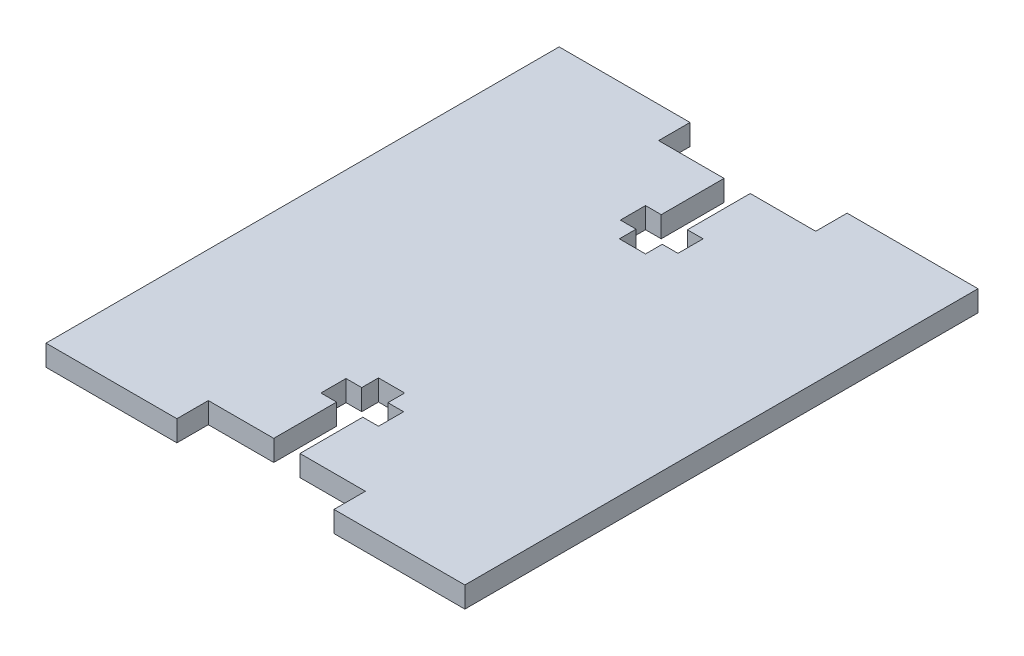
ISO-10303-21;
HEADER;
FILE_DESCRIPTION(('STEP AP214'),'2;1');
FILE_NAME('part.step','',(''),(''),'','','');
FILE_SCHEMA(('AUTOMOTIVE_DESIGN { 1 0 10303 214 1 1 1 1 }'));
ENDSEC;
DATA;
#1=APPLICATION_CONTEXT('core data for automotive mechanical design processes');
#2=APPLICATION_PROTOCOL_DEFINITION('international standard','automotive_design',2000,#1);
#3=PRODUCT_CONTEXT('',#1,'mechanical');
#4=PRODUCT('Part','Part','',(#3));
#5=PRODUCT_RELATED_PRODUCT_CATEGORY('part','',(#4));
#6=PRODUCT_DEFINITION_FORMATION('','',#4);
#7=PRODUCT_DEFINITION_CONTEXT('part definition',#1,'design');
#8=PRODUCT_DEFINITION('design','',#6,#7);
#9=PRODUCT_DEFINITION_SHAPE('','',#8);
#10=(LENGTH_UNIT() NAMED_UNIT(*) SI_UNIT(.MILLI.,.METRE.));
#11=(NAMED_UNIT(*) PLANE_ANGLE_UNIT() SI_UNIT($,.RADIAN.));
#12=(NAMED_UNIT(*) SI_UNIT($,.STERADIAN.) SOLID_ANGLE_UNIT());
#13=UNCERTAINTY_MEASURE_WITH_UNIT(LENGTH_MEASURE(1.E-05),#10,'distance_accuracy_value','');
#14=(GEOMETRIC_REPRESENTATION_CONTEXT(3) GLOBAL_UNCERTAINTY_ASSIGNED_CONTEXT((#13)) GLOBAL_UNIT_ASSIGNED_CONTEXT((#10,
#11,#12)) REPRESENTATION_CONTEXT('',''));
#15=CARTESIAN_POINT('',(0.,0.,0.));
#16=DIRECTION('',(0.,0.,1.));
#17=DIRECTION('',(1.,0.,0.));
#18=AXIS2_PLACEMENT_3D('',#15,#16,#17);
#19=CARTESIAN_POINT('',(-42.0649491402793,-2.,-17.7189241382306));
#20=DIRECTION('',(0.,0.,1.));
#21=DIRECTION('',(1.,0.,0.));
#22=AXIS2_PLACEMENT_3D('',#19,#20,#21);
#23=PLANE('',#22);
#24=DIRECTION('',(1.,0.,0.));
#25=VECTOR('',#24,1.);
#26=CARTESIAN_POINT('',(-42.0649491402793,0.,-17.7189241382306));
#27=LINE('',#26,#25);
#28=CARTESIAN_POINT('',(-42.0649491402793,0.,-17.7189241382306));
#29=VERTEX_POINT('',#28);
#30=CARTESIAN_POINT('',(-35.8149491402793,0.,-17.7189241382306));
#31=VERTEX_POINT('',#30);
#32=EDGE_CURVE('E472',#29,#31,#27,.T.);
#33=ORIENTED_EDGE('',*,*,#32,.T.);
#34=DIRECTION('',(0.,1.,0.));
#35=VECTOR('',#34,1.);
#36=CARTESIAN_POINT('',(-35.8149491402793,-2.,-17.7189241382306));
#37=LINE('',#36,#35);
#38=CARTESIAN_POINT('',(-35.8149491402793,-2.,-17.7189241382306));
#39=VERTEX_POINT('',#38);
#40=EDGE_CURVE('E356',#39,#31,#37,.T.);
#41=ORIENTED_EDGE('',*,*,#40,.F.);
#42=DIRECTION('',(1.,0.,0.));
#43=VECTOR('',#42,1.);
#44=CARTESIAN_POINT('',(-42.0649491402793,-2.,-17.7189241382306));
#45=LINE('',#44,#43);
#46=CARTESIAN_POINT('',(-42.0649491402793,-2.,-17.7189241382306));
#47=VERTEX_POINT('',#46);
#48=EDGE_CURVE('E462',#47,#39,#45,.T.);
#49=ORIENTED_EDGE('',*,*,#48,.F.);
#50=DIRECTION('',(0.,1.,0.));
#51=VECTOR('',#50,1.);
#52=CARTESIAN_POINT('',(-42.0649491402793,-2.,-17.7189241382306));
#53=LINE('',#52,#51);
#54=EDGE_CURVE('E483',#47,#29,#53,.T.);
#55=ORIENTED_EDGE('',*,*,#54,.T.);
#56=EDGE_LOOP('',(#33,#41,#49,#55));
#57=FACE_BOUND('',#56,.T.);
#58=ADVANCED_FACE('F35',(#57),#23,.F.);
#59=CARTESIAN_POINT('',(-42.0649491402793,-2.,25.2810758617694));
#60=DIRECTION('',(0.,0.,-1.));
#61=DIRECTION('',(-1.,0.,0.));
#62=AXIS2_PLACEMENT_3D('',#59,#60,#61);
#63=PLANE('',#62);
#64=DIRECTION('',(-1.,0.,0.));
#65=VECTOR('',#64,1.);
#66=CARTESIAN_POINT('',(-42.0649491402793,0.,25.2810758617694));
#67=LINE('',#66,#65);
#68=CARTESIAN_POINT('',(-27.0649491402793,0.,25.2810758617694));
#69=VERTEX_POINT('',#68);
#70=CARTESIAN_POINT('',(-33.3149491402793,0.,25.2810758617694));
#71=VERTEX_POINT('',#70);
#72=EDGE_CURVE('E490',#69,#71,#67,.T.);
#73=ORIENTED_EDGE('',*,*,#72,.T.);
#74=DIRECTION('',(0.,1.,0.));
#75=VECTOR('',#74,1.);
#76=CARTESIAN_POINT('',(-33.3149491402793,-2.,25.2810758617694));
#77=LINE('',#76,#75);
#78=CARTESIAN_POINT('',(-33.3149491402793,-2.,25.2810758617694));
#79=VERTEX_POINT('',#78);
#80=EDGE_CURVE('E450',#79,#71,#77,.T.);
#81=ORIENTED_EDGE('',*,*,#80,.F.);
#82=DIRECTION('',(-1.,0.,0.));
#83=VECTOR('',#82,1.);
#84=CARTESIAN_POINT('',(-42.0649491402793,-2.,25.2810758617694));
#85=LINE('',#84,#83);
#86=CARTESIAN_POINT('',(-27.0649491402793,-2.,25.2810758617694));
#87=VERTEX_POINT('',#86);
#88=EDGE_CURVE('E494',#87,#79,#85,.T.);
#89=ORIENTED_EDGE('',*,*,#88,.F.);
#90=DIRECTION('',(0.,1.,0.));
#91=VECTOR('',#90,1.);
#92=CARTESIAN_POINT('',(-27.0649491402793,-2.,25.2810758617694));
#93=LINE('',#92,#91);
#94=EDGE_CURVE('E509',#87,#69,#93,.T.);
#95=ORIENTED_EDGE('',*,*,#94,.T.);
#96=EDGE_LOOP('',(#73,#81,#89,#95));
#97=FACE_BOUND('',#96,.T.);
#98=ADVANCED_FACE('F620',(#97),#63,.F.);
#99=CARTESIAN_POINT('',(-54.5649491402793,-2.,-20.7189241382306));
#100=DIRECTION('',(0.,0.,-1.));
#101=DIRECTION('',(-1.,0.,0.));
#102=AXIS2_PLACEMENT_3D('',#99,#100,#101);
#103=PLANE('',#102);
#104=DIRECTION('',(0.,1.,0.));
#105=VECTOR('',#104,1.);
#106=CARTESIAN_POINT('',(-27.0649491402793,-2.,-20.7189241382306));
#107=LINE('',#106,#105);
#108=CARTESIAN_POINT('',(-27.0649491402793,-2.,-20.7189241382306));
#109=VERTEX_POINT('',#108);
#110=CARTESIAN_POINT('',(-27.0649491402793,0.,-20.7189241382306));
#111=VERTEX_POINT('',#110);
#112=EDGE_CURVE('E476',#109,#111,#107,.T.);
#113=ORIENTED_EDGE('',*,*,#112,.T.);
#114=DIRECTION('',(-1.,0.,0.));
#115=VECTOR('',#114,1.);
#116=CARTESIAN_POINT('',(-54.5649491402793,0.,-20.7189241382306));
#117=LINE('',#116,#115);
#118=CARTESIAN_POINT('',(-14.5649491402793,0.,-20.7189241382306));
#119=VERTEX_POINT('',#118);
#120=EDGE_CURVE('E519',#119,#111,#117,.T.);
#121=ORIENTED_EDGE('',*,*,#120,.F.);
#122=DIRECTION('',(0.,1.,0.));
#123=VECTOR('',#122,1.);
#124=CARTESIAN_POINT('',(-14.5649491402793,-2.,-20.7189241382306));
#125=LINE('',#124,#123);
#126=CARTESIAN_POINT('',(-14.5649491402793,-2.,-20.7189241382306));
#127=VERTEX_POINT('',#126);
#128=EDGE_CURVE('E44',#127,#119,#125,.T.);
#129=ORIENTED_EDGE('',*,*,#128,.F.);
#130=DIRECTION('',(-1.,0.,0.));
#131=VECTOR('',#130,1.);
#132=CARTESIAN_POINT('',(-54.5649491402793,-2.,-20.7189241382306));
#133=LINE('',#132,#131);
#134=EDGE_CURVE('E527',#127,#109,#133,.T.);
#135=ORIENTED_EDGE('',*,*,#134,.T.);
#136=EDGE_LOOP('',(#113,#121,#129,#135));
#137=FACE_BOUND('',#136,.T.);
#138=ADVANCED_FACE('F634',(#137),#103,.T.);
#139=CARTESIAN_POINT('',(-54.5649491402793,-2.,28.2810758617694));
#140=DIRECTION('',(0.,0.,1.));
#141=DIRECTION('',(1.,0.,0.));
#142=AXIS2_PLACEMENT_3D('',#139,#140,#141);
#143=PLANE('',#142);
#144=DIRECTION('',(0.,1.,0.));
#145=VECTOR('',#144,1.);
#146=CARTESIAN_POINT('',(-42.0649491402793,-2.,28.2810758617694));
#147=LINE('',#146,#145);
#148=CARTESIAN_POINT('',(-42.0649491402793,-2.,28.2810758617694));
#149=VERTEX_POINT('',#148);
#150=CARTESIAN_POINT('',(-42.0649491402793,0.,28.2810758617694));
#151=VERTEX_POINT('',#150);
#152=EDGE_CURVE('E497',#149,#151,#147,.T.);
#153=ORIENTED_EDGE('',*,*,#152,.T.);
#154=DIRECTION('',(1.,0.,0.));
#155=VECTOR('',#154,1.);
#156=CARTESIAN_POINT('',(-54.5649491402793,0.,28.2810758617694));
#157=LINE('',#156,#155);
#158=CARTESIAN_POINT('',(-54.5649491402793,0.,28.2810758617694));
#159=VERTEX_POINT('',#158);
#160=EDGE_CURVE('E533',#159,#151,#157,.T.);
#161=ORIENTED_EDGE('',*,*,#160,.F.);
#162=DIRECTION('',(0.,1.,0.));
#163=VECTOR('',#162,1.);
#164=CARTESIAN_POINT('',(-54.5649491402793,-2.,28.2810758617694));
#165=LINE('',#164,#163);
#166=CARTESIAN_POINT('',(-54.5649491402793,-2.,28.2810758617694));
#167=VERTEX_POINT('',#166);
#168=EDGE_CURVE('E39',#167,#159,#165,.T.);
#169=ORIENTED_EDGE('',*,*,#168,.F.);
#170=DIRECTION('',(1.,0.,0.));
#171=VECTOR('',#170,1.);
#172=CARTESIAN_POINT('',(-54.5649491402793,-2.,28.2810758617694));
#173=LINE('',#172,#171);
#174=EDGE_CURVE('E520',#167,#149,#173,.T.);
#175=ORIENTED_EDGE('',*,*,#174,.T.);
#176=EDGE_LOOP('',(#153,#161,#169,#175));
#177=FACE_BOUND('',#176,.T.);
#178=ADVANCED_FACE('F555',(#177),#143,.T.);
#179=CARTESIAN_POINT('',(-54.5649491402793,-2.,28.2810758617694));
#180=DIRECTION('',(-1.,0.,0.));
#181=DIRECTION('',(0.,0.,1.));
#182=AXIS2_PLACEMENT_3D('',#179,#180,#181);
#183=PLANE('',#182);
#184=DIRECTION('',(0.,0.,1.));
#185=VECTOR('',#184,1.);
#186=CARTESIAN_POINT('',(-54.5649491402793,0.,28.2810758617694));
#187=LINE('',#186,#185);
#188=CARTESIAN_POINT('',(-54.5649491402793,0.,-20.7189241382306));
#189=VERTEX_POINT('',#188);
#190=EDGE_CURVE('E508',#189,#159,#187,.T.);
#191=ORIENTED_EDGE('',*,*,#190,.F.);
#192=DIRECTION('',(0.,1.,0.));
#193=VECTOR('',#192,1.);
#194=CARTESIAN_POINT('',(-54.5649491402793,-2.,-20.7189241382306));
#195=LINE('',#194,#193);
#196=CARTESIAN_POINT('',(-54.5649491402793,-2.,-20.7189241382306));
#197=VERTEX_POINT('',#196);
#198=EDGE_CURVE('E11',#197,#189,#195,.T.);
#199=ORIENTED_EDGE('',*,*,#198,.F.);
#200=DIRECTION('',(0.,0.,1.));
#201=VECTOR('',#200,1.);
#202=CARTESIAN_POINT('',(-54.5649491402793,-2.,28.2810758617694));
#203=LINE('',#202,#201);
#204=EDGE_CURVE('E515',#197,#167,#203,.T.);
#205=ORIENTED_EDGE('',*,*,#204,.T.);
#206=ORIENTED_EDGE('',*,*,#168,.T.);
#207=EDGE_LOOP('',(#191,#199,#205,#206));
#208=FACE_BOUND('',#207,.T.);
#209=ADVANCED_FACE('F37',(#208),#183,.T.);
#210=DIRECTION('',(0.,1.,0.));
#211=VECTOR('',#210,1.);
#212=CARTESIAN_POINT('',(-42.0649491402793,-2.,-20.7189241382306));
#213=LINE('',#212,#211);
#214=CARTESIAN_POINT('',(-42.0649491402793,-2.,-20.7189241382306));
#215=VERTEX_POINT('',#214);
#216=CARTESIAN_POINT('',(-42.0649491402793,0.,-20.7189241382306));
#217=VERTEX_POINT('',#216);
#218=EDGE_CURVE('E468',#215,#217,#213,.T.);
#219=ORIENTED_EDGE('',*,*,#218,.F.);
#220=EDGE_CURVE('E526',#215,#197,#133,.T.);
#221=ORIENTED_EDGE('',*,*,#220,.T.);
#222=ORIENTED_EDGE('',*,*,#198,.T.);
#223=EDGE_CURVE('E539',#217,#189,#117,.T.);
#224=ORIENTED_EDGE('',*,*,#223,.F.);
#225=EDGE_LOOP('',(#219,#221,#222,#224));
#226=FACE_BOUND('',#225,.T.);
#227=ADVANCED_FACE('F565',(#226),#103,.T.);
#228=CARTESIAN_POINT('',(-14.5649491402793,-2.,28.2810758617694));
#229=DIRECTION('',(1.,0.,0.));
#230=DIRECTION('',(0.,0.,-1.));
#231=AXIS2_PLACEMENT_3D('',#228,#229,#230);
#232=PLANE('',#231);
#233=DIRECTION('',(0.,0.,-1.));
#234=VECTOR('',#233,1.);
#235=CARTESIAN_POINT('',(-14.5649491402793,0.,28.2810758617694));
#236=LINE('',#235,#234);
#237=CARTESIAN_POINT('',(-14.5649491402793,0.,28.2810758617694));
#238=VERTEX_POINT('',#237);
#239=EDGE_CURVE('E536',#238,#119,#236,.T.);
#240=ORIENTED_EDGE('',*,*,#239,.F.);
#241=DIRECTION('',(0.,1.,0.));
#242=VECTOR('',#241,1.);
#243=CARTESIAN_POINT('',(-14.5649491402793,-2.,28.2810758617694));
#244=LINE('',#243,#242);
#245=CARTESIAN_POINT('',(-14.5649491402793,-2.,28.2810758617694));
#246=VERTEX_POINT('',#245);
#247=EDGE_CURVE('E542',#246,#238,#244,.T.);
#248=ORIENTED_EDGE('',*,*,#247,.F.);
#249=DIRECTION('',(0.,0.,-1.));
#250=VECTOR('',#249,1.);
#251=CARTESIAN_POINT('',(-14.5649491402793,-2.,28.2810758617694));
#252=LINE('',#251,#250);
#253=EDGE_CURVE('E523',#246,#127,#252,.T.);
#254=ORIENTED_EDGE('',*,*,#253,.T.);
#255=ORIENTED_EDGE('',*,*,#128,.T.);
#256=EDGE_LOOP('',(#240,#248,#254,#255));
#257=FACE_BOUND('',#256,.T.);
#258=ADVANCED_FACE('F630',(#257),#232,.T.);
#259=DIRECTION('',(0.,1.,0.));
#260=VECTOR('',#259,1.);
#261=CARTESIAN_POINT('',(-27.0649491402793,-2.,28.2810758617694));
#262=LINE('',#261,#260);
#263=CARTESIAN_POINT('',(-27.0649491402793,-2.,28.2810758617694));
#264=VERTEX_POINT('',#263);
#265=CARTESIAN_POINT('',(-27.0649491402793,0.,28.2810758617694));
#266=VERTEX_POINT('',#265);
#267=EDGE_CURVE('E511',#264,#266,#262,.T.);
#268=ORIENTED_EDGE('',*,*,#267,.F.);
#269=EDGE_CURVE('E518',#264,#246,#173,.T.);
#270=ORIENTED_EDGE('',*,*,#269,.T.);
#271=ORIENTED_EDGE('',*,*,#247,.T.);
#272=EDGE_CURVE('E532',#266,#238,#157,.T.);
#273=ORIENTED_EDGE('',*,*,#272,.F.);
#274=EDGE_LOOP('',(#268,#270,#271,#273));
#275=FACE_BOUND('',#274,.T.);
#276=ADVANCED_FACE('F625',(#275),#143,.T.);
#277=CARTESIAN_POINT('',(0.,-2.,0.));
#278=DIRECTION('',(0.,-1.,0.));
#279=DIRECTION('',(0.,0.,-1.));
#280=AXIS2_PLACEMENT_3D('',#277,#278,#279);
#281=PLANE('',#280);
#282=DIRECTION('',(0.,0.,1.));
#283=VECTOR('',#282,1.);
#284=CARTESIAN_POINT('',(-35.8149491402793,-2.,-17.7189241382306));
#285=LINE('',#284,#283);
#286=CARTESIAN_POINT('',(-35.8149491402793,-2.,-11.7189241382306));
#287=VERTEX_POINT('',#286);
#288=EDGE_CURVE('E315',#39,#287,#285,.T.);
#289=ORIENTED_EDGE('',*,*,#288,.T.);
#290=DIRECTION('',(-1.,0.,0.));
#291=VECTOR('',#290,1.);
#292=CARTESIAN_POINT('',(-35.8149491402793,-2.,-11.7189241382306));
#293=LINE('',#292,#291);
#294=CARTESIAN_POINT('',(-37.3149491402793,-2.,-11.7189241382306));
#295=VERTEX_POINT('',#294);
#296=EDGE_CURVE('E317',#287,#295,#293,.T.);
#297=ORIENTED_EDGE('',*,*,#296,.T.);
#298=DIRECTION('',(0.,0.,1.));
#299=VECTOR('',#298,1.);
#300=CARTESIAN_POINT('',(-37.3149491402793,-2.,-11.7189241382306));
#301=LINE('',#300,#299);
#302=CARTESIAN_POINT('',(-37.3149491402793,-2.,-9.31892413823061));
#303=VERTEX_POINT('',#302);
#304=EDGE_CURVE('E320',#295,#303,#301,.T.);
#305=ORIENTED_EDGE('',*,*,#304,.T.);
#306=DIRECTION('',(1.,0.,0.));
#307=VECTOR('',#306,1.);
#308=CARTESIAN_POINT('',(-37.3149491402793,-2.,-9.31892413823061));
#309=LINE('',#308,#307);
#310=CARTESIAN_POINT('',(-35.8149491402793,-2.,-9.31892413823061));
#311=VERTEX_POINT('',#310);
#312=EDGE_CURVE('E282',#303,#311,#309,.T.);
#313=ORIENTED_EDGE('',*,*,#312,.T.);
#314=DIRECTION('',(0.,0.,1.));
#315=VECTOR('',#314,1.);
#316=CARTESIAN_POINT('',(-35.8149491402793,-2.,-9.31892413823061));
#317=LINE('',#316,#315);
#318=CARTESIAN_POINT('',(-35.8149491402793,-2.,-7.71892413823061));
#319=VERTEX_POINT('',#318);
#320=EDGE_CURVE('E274',#311,#319,#317,.T.);
#321=ORIENTED_EDGE('',*,*,#320,.T.);
#322=DIRECTION('',(1.,0.,0.));
#323=VECTOR('',#322,1.);
#324=CARTESIAN_POINT('',(-35.8149491402793,-2.,-7.71892413823061));
#325=LINE('',#324,#323);
#326=CARTESIAN_POINT('',(-33.3149491402793,-2.,-7.71892413823061));
#327=VERTEX_POINT('',#326);
#328=EDGE_CURVE('E285',#319,#327,#325,.T.);
#329=ORIENTED_EDGE('',*,*,#328,.T.);
#330=DIRECTION('',(0.,0.,-1.));
#331=VECTOR('',#330,1.);
#332=CARTESIAN_POINT('',(-33.3149491402793,-2.,-7.71892413823061));
#333=LINE('',#332,#331);
#334=CARTESIAN_POINT('',(-33.3149491402793,-2.,-9.31892413823061));
#335=VERTEX_POINT('',#334);
#336=EDGE_CURVE('E290',#327,#335,#333,.T.);
#337=ORIENTED_EDGE('',*,*,#336,.T.);
#338=DIRECTION('',(1.,0.,0.));
#339=VECTOR('',#338,1.);
#340=CARTESIAN_POINT('',(-33.3149491402793,-2.,-9.31892413823061));
#341=LINE('',#340,#339);
#342=CARTESIAN_POINT('',(-31.8149491402793,-2.,-9.31892413823061));
#343=VERTEX_POINT('',#342);
#344=EDGE_CURVE('E303',#335,#343,#341,.T.);
#345=ORIENTED_EDGE('',*,*,#344,.T.);
#346=DIRECTION('',(0.,0.,-1.));
#347=VECTOR('',#346,1.);
#348=CARTESIAN_POINT('',(-31.8149491402793,-2.,-9.31892413823061));
#349=LINE('',#348,#347);
#350=CARTESIAN_POINT('',(-31.8149491402793,-2.,-11.7189241382306));
#351=VERTEX_POINT('',#350);
#352=EDGE_CURVE('E306',#343,#351,#349,.T.);
#353=ORIENTED_EDGE('',*,*,#352,.T.);
#354=DIRECTION('',(-1.,0.,0.));
#355=VECTOR('',#354,1.);
#356=CARTESIAN_POINT('',(-31.8149491402793,-2.,-11.7189241382306));
#357=LINE('',#356,#355);
#358=CARTESIAN_POINT('',(-33.3149491402793,-2.,-11.7189241382306));
#359=VERTEX_POINT('',#358);
#360=EDGE_CURVE('E309',#351,#359,#357,.T.);
#361=ORIENTED_EDGE('',*,*,#360,.T.);
#362=DIRECTION('',(0.,0.,-1.));
#363=VECTOR('',#362,1.);
#364=CARTESIAN_POINT('',(-33.3149491402793,-2.,-11.7189241382306));
#365=LINE('',#364,#363);
#366=CARTESIAN_POINT('',(-33.3149491402793,-2.,-17.7189241382306));
#367=VERTEX_POINT('',#366);
#368=EDGE_CURVE('E312',#359,#367,#365,.T.);
#369=ORIENTED_EDGE('',*,*,#368,.T.);
#370=CARTESIAN_POINT('',(-27.0649491402793,-2.,-17.7189241382306));
#371=VERTEX_POINT('',#370);
#372=EDGE_CURVE('E460',#367,#371,#45,.T.);
#373=ORIENTED_EDGE('',*,*,#372,.T.);
#374=DIRECTION('',(0.,0.,-1.));
#375=VECTOR('',#374,1.);
#376=CARTESIAN_POINT('',(-27.0649491402793,-2.,-20.7189241382306));
#377=LINE('',#376,#375);
#378=EDGE_CURVE('E465',#371,#109,#377,.T.);
#379=ORIENTED_EDGE('',*,*,#378,.T.);
#380=ORIENTED_EDGE('',*,*,#134,.F.);
#381=ORIENTED_EDGE('',*,*,#253,.F.);
#382=ORIENTED_EDGE('',*,*,#269,.F.);
#383=DIRECTION('',(0.,0.,-1.));
#384=VECTOR('',#383,1.);
#385=CARTESIAN_POINT('',(-27.0649491402793,-2.,28.2810758617694));
#386=LINE('',#385,#384);
#387=EDGE_CURVE('E489',#264,#87,#386,.T.);
#388=ORIENTED_EDGE('',*,*,#387,.T.);
#389=ORIENTED_EDGE('',*,*,#88,.T.);
#390=DIRECTION('',(0.,0.,-1.));
#391=VECTOR('',#390,1.);
#392=CARTESIAN_POINT('',(-33.3149491402793,-2.,19.2810758617694));
#393=LINE('',#392,#391);
#394=CARTESIAN_POINT('',(-33.3149491402793,-2.,19.2810758617694));
#395=VERTEX_POINT('',#394);
#396=EDGE_CURVE('E379',#79,#395,#393,.T.);
#397=ORIENTED_EDGE('',*,*,#396,.T.);
#398=DIRECTION('',(1.,0.,0.));
#399=VECTOR('',#398,1.);
#400=CARTESIAN_POINT('',(-31.8149491402793,-2.,19.2810758617694));
#401=LINE('',#400,#399);
#402=CARTESIAN_POINT('',(-31.8149491402793,-2.,19.2810758617694));
#403=VERTEX_POINT('',#402);
#404=EDGE_CURVE('E382',#395,#403,#401,.T.);
#405=ORIENTED_EDGE('',*,*,#404,.T.);
#406=DIRECTION('',(0.,0.,-1.));
#407=VECTOR('',#406,1.);
#408=CARTESIAN_POINT('',(-31.8149491402793,-2.,16.8810758617694));
#409=LINE('',#408,#407);
#410=CARTESIAN_POINT('',(-31.8149491402793,-2.,16.8810758617694));
#411=VERTEX_POINT('',#410);
#412=EDGE_CURVE('E385',#403,#411,#409,.T.);
#413=ORIENTED_EDGE('',*,*,#412,.T.);
#414=DIRECTION('',(-1.,0.,0.));
#415=VECTOR('',#414,1.);
#416=CARTESIAN_POINT('',(-33.3149491402793,-2.,16.8810758617694));
#417=LINE('',#416,#415);
#418=CARTESIAN_POINT('',(-33.3149491402793,-2.,16.8810758617694));
#419=VERTEX_POINT('',#418);
#420=EDGE_CURVE('E388',#411,#419,#417,.T.);
#421=ORIENTED_EDGE('',*,*,#420,.T.);
#422=DIRECTION('',(0.,0.,-1.));
#423=VECTOR('',#422,1.);
#424=CARTESIAN_POINT('',(-33.3149491402793,-2.,15.2810758617694));
#425=LINE('',#424,#423);
#426=CARTESIAN_POINT('',(-33.3149491402793,-2.,15.2810758617694));
#427=VERTEX_POINT('',#426);
#428=EDGE_CURVE('E391',#419,#427,#425,.T.);
#429=ORIENTED_EDGE('',*,*,#428,.T.);
#430=DIRECTION('',(-1.,0.,0.));
#431=VECTOR('',#430,1.);
#432=CARTESIAN_POINT('',(-35.8149491402793,-2.,15.2810758617694));
#433=LINE('',#432,#431);
#434=CARTESIAN_POINT('',(-35.8149491402793,-2.,15.2810758617694));
#435=VERTEX_POINT('',#434);
#436=EDGE_CURVE('E394',#427,#435,#433,.T.);
#437=ORIENTED_EDGE('',*,*,#436,.T.);
#438=DIRECTION('',(0.,0.,1.));
#439=VECTOR('',#438,1.);
#440=CARTESIAN_POINT('',(-35.8149491402793,-2.,16.8810758617694));
#441=LINE('',#440,#439);
#442=CARTESIAN_POINT('',(-35.8149491402793,-2.,16.8810758617694));
#443=VERTEX_POINT('',#442);
#444=EDGE_CURVE('E397',#435,#443,#441,.T.);
#445=ORIENTED_EDGE('',*,*,#444,.T.);
#446=DIRECTION('',(-1.,0.,0.));
#447=VECTOR('',#446,1.);
#448=CARTESIAN_POINT('',(-37.3149491402793,-2.,16.8810758617694));
#449=LINE('',#448,#447);
#450=CARTESIAN_POINT('',(-37.3149491402793,-2.,16.8810758617694));
#451=VERTEX_POINT('',#450);
#452=EDGE_CURVE('E400',#443,#451,#449,.T.);
#453=ORIENTED_EDGE('',*,*,#452,.T.);
#454=DIRECTION('',(0.,0.,1.));
#455=VECTOR('',#454,1.);
#456=CARTESIAN_POINT('',(-37.3149491402793,-2.,19.2810758617694));
#457=LINE('',#456,#455);
#458=CARTESIAN_POINT('',(-37.3149491402793,-2.,19.2810758617694));
#459=VERTEX_POINT('',#458);
#460=EDGE_CURVE('E369',#451,#459,#457,.T.);
#461=ORIENTED_EDGE('',*,*,#460,.T.);
#462=DIRECTION('',(1.,0.,0.));
#463=VECTOR('',#462,1.);
#464=CARTESIAN_POINT('',(-35.8149491402793,-2.,19.2810758617694));
#465=LINE('',#464,#463);
#466=CARTESIAN_POINT('',(-35.8149491402793,-2.,19.2810758617694));
#467=VERTEX_POINT('',#466);
#468=EDGE_CURVE('E372',#459,#467,#465,.T.);
#469=ORIENTED_EDGE('',*,*,#468,.T.);
#470=DIRECTION('',(0.,0.,1.));
#471=VECTOR('',#470,1.);
#472=CARTESIAN_POINT('',(-35.8149491402793,-2.,25.2810758617694));
#473=LINE('',#472,#471);
#474=CARTESIAN_POINT('',(-35.8149491402793,-2.,25.2810758617694));
#475=VERTEX_POINT('',#474);
#476=EDGE_CURVE('E376',#467,#475,#473,.T.);
#477=ORIENTED_EDGE('',*,*,#476,.T.);
#478=CARTESIAN_POINT('',(-42.0649491402793,-2.,25.2810758617694));
#479=VERTEX_POINT('',#478);
#480=EDGE_CURVE('E493',#475,#479,#85,.T.);
#481=ORIENTED_EDGE('',*,*,#480,.T.);
#482=DIRECTION('',(0.,0.,1.));
#483=VECTOR('',#482,1.);
#484=CARTESIAN_POINT('',(-42.0649491402793,-2.,28.2810758617694));
#485=LINE('',#484,#483);
#486=EDGE_CURVE('E486',#479,#149,#485,.T.);
#487=ORIENTED_EDGE('',*,*,#486,.T.);
#488=ORIENTED_EDGE('',*,*,#174,.F.);
#489=ORIENTED_EDGE('',*,*,#204,.F.);
#490=ORIENTED_EDGE('',*,*,#220,.F.);
#491=DIRECTION('',(0.,0.,1.));
#492=VECTOR('',#491,1.);
#493=CARTESIAN_POINT('',(-42.0649491402793,-2.,-20.7189241382306));
#494=LINE('',#493,#492);
#495=EDGE_CURVE('E457',#215,#47,#494,.T.);
#496=ORIENTED_EDGE('',*,*,#495,.T.);
#497=ORIENTED_EDGE('',*,*,#48,.T.);
#498=EDGE_LOOP('',(#289,#297,#305,#313,#321,#329,#337,#345,#353,#361,#369,#373,#379,#380,#381,
#382,#388,#389,#397,#405,#413,#421,#429,#437,#445,#453,#461,#469,#477,#481,#487,#488,#489,#490,
#496,#497));
#499=FACE_BOUND('',#498,.T.);
#500=ADVANCED_FACE('F293',(#499),#281,.T.);
#501=CARTESIAN_POINT('',(0.,0.,0.));
#502=DIRECTION('',(0.,-1.,0.));
#503=DIRECTION('',(0.,0.,-1.));
#504=AXIS2_PLACEMENT_3D('',#501,#502,#503);
#505=PLANE('',#504);
#506=DIRECTION('',(-1.,0.,0.));
#507=VECTOR('',#506,1.);
#508=CARTESIAN_POINT('',(-35.8149491402793,0.,-11.7189241382306));
#509=LINE('',#508,#507);
#510=CARTESIAN_POINT('',(-35.8149491402793,0.,-11.7189241382306));
#511=VERTEX_POINT('',#510);
#512=CARTESIAN_POINT('',(-37.3149491402793,0.,-11.7189241382306));
#513=VERTEX_POINT('',#512);
#514=EDGE_CURVE('E342',#511,#513,#509,.T.);
#515=ORIENTED_EDGE('',*,*,#514,.F.);
#516=DIRECTION('',(0.,0.,1.));
#517=VECTOR('',#516,1.);
#518=CARTESIAN_POINT('',(-35.8149491402793,0.,-17.7189241382306));
#519=LINE('',#518,#517);
#520=EDGE_CURVE('E339',#31,#511,#519,.T.);
#521=ORIENTED_EDGE('',*,*,#520,.F.);
#522=ORIENTED_EDGE('',*,*,#32,.F.);
#523=DIRECTION('',(0.,0.,1.));
#524=VECTOR('',#523,1.);
#525=CARTESIAN_POINT('',(-42.0649491402793,0.,-20.7189241382306));
#526=LINE('',#525,#524);
#527=EDGE_CURVE('E435',#217,#29,#526,.T.);
#528=ORIENTED_EDGE('',*,*,#527,.F.);
#529=ORIENTED_EDGE('',*,*,#223,.T.);
#530=ORIENTED_EDGE('',*,*,#190,.T.);
#531=ORIENTED_EDGE('',*,*,#160,.T.);
#532=DIRECTION('',(0.,0.,1.));
#533=VECTOR('',#532,1.);
#534=CARTESIAN_POINT('',(-42.0649491402793,0.,28.2810758617694));
#535=LINE('',#534,#533);
#536=CARTESIAN_POINT('',(-42.0649491402793,0.,25.2810758617694));
#537=VERTEX_POINT('',#536);
#538=EDGE_CURVE('E479',#537,#151,#535,.T.);
#539=ORIENTED_EDGE('',*,*,#538,.F.);
#540=CARTESIAN_POINT('',(-35.8149491402793,0.,25.2810758617694));
#541=VERTEX_POINT('',#540);
#542=EDGE_CURVE('E502',#541,#537,#67,.T.);
#543=ORIENTED_EDGE('',*,*,#542,.F.);
#544=DIRECTION('',(0.,0.,1.));
#545=VECTOR('',#544,1.);
#546=CARTESIAN_POINT('',(-35.8149491402793,0.,25.2810758617694));
#547=LINE('',#546,#545);
#548=CARTESIAN_POINT('',(-35.8149491402793,0.,19.2810758617694));
#549=VERTEX_POINT('',#548);
#550=EDGE_CURVE('E60',#549,#541,#547,.T.);
#551=ORIENTED_EDGE('',*,*,#550,.F.);
#552=DIRECTION('',(1.,0.,0.));
#553=VECTOR('',#552,1.);
#554=CARTESIAN_POINT('',(-35.8149491402793,0.,19.2810758617694));
#555=LINE('',#554,#553);
#556=CARTESIAN_POINT('',(-37.3149491402793,0.,19.2810758617694));
#557=VERTEX_POINT('',#556);
#558=EDGE_CURVE('E406',#557,#549,#555,.T.);
#559=ORIENTED_EDGE('',*,*,#558,.F.);
#560=DIRECTION('',(0.,0.,1.));
#561=VECTOR('',#560,1.);
#562=CARTESIAN_POINT('',(-37.3149491402793,0.,19.2810758617694));
#563=LINE('',#562,#561);
#564=CARTESIAN_POINT('',(-37.3149491402793,0.,16.8810758617694));
#565=VERTEX_POINT('',#564);
#566=EDGE_CURVE('E349',#565,#557,#563,.T.);
#567=ORIENTED_EDGE('',*,*,#566,.F.);
#568=DIRECTION('',(-1.,0.,0.));
#569=VECTOR('',#568,1.);
#570=CARTESIAN_POINT('',(-37.3149491402793,0.,16.8810758617694));
#571=LINE('',#570,#569);
#572=CARTESIAN_POINT('',(-35.8149491402793,0.,16.8810758617694));
#573=VERTEX_POINT('',#572);
#574=EDGE_CURVE('E373',#573,#565,#571,.T.);
#575=ORIENTED_EDGE('',*,*,#574,.F.);
#576=DIRECTION('',(0.,0.,1.));
#577=VECTOR('',#576,1.);
#578=CARTESIAN_POINT('',(-35.8149491402793,0.,16.8810758617694));
#579=LINE('',#578,#577);
#580=CARTESIAN_POINT('',(-35.8149491402793,0.,15.2810758617694));
#581=VERTEX_POINT('',#580);
#582=EDGE_CURVE('E428',#581,#573,#579,.T.);
#583=ORIENTED_EDGE('',*,*,#582,.F.);
#584=DIRECTION('',(-1.,0.,0.));
#585=VECTOR('',#584,1.);
#586=CARTESIAN_POINT('',(-35.8149491402793,0.,15.2810758617694));
#587=LINE('',#586,#585);
#588=CARTESIAN_POINT('',(-33.3149491402793,0.,15.2810758617694));
#589=VERTEX_POINT('',#588);
#590=EDGE_CURVE('E425',#589,#581,#587,.T.);
#591=ORIENTED_EDGE('',*,*,#590,.F.);
#592=DIRECTION('',(0.,0.,-1.));
#593=VECTOR('',#592,1.);
#594=CARTESIAN_POINT('',(-33.3149491402793,0.,15.2810758617694));
#595=LINE('',#594,#593);
#596=CARTESIAN_POINT('',(-33.3149491402793,0.,16.8810758617694));
#597=VERTEX_POINT('',#596);
#598=EDGE_CURVE('E422',#597,#589,#595,.T.);
#599=ORIENTED_EDGE('',*,*,#598,.F.);
#600=DIRECTION('',(-1.,0.,0.));
#601=VECTOR('',#600,1.);
#602=CARTESIAN_POINT('',(-33.3149491402793,0.,16.8810758617694));
#603=LINE('',#602,#601);
#604=CARTESIAN_POINT('',(-31.8149491402793,0.,16.8810758617694));
#605=VERTEX_POINT('',#604);
#606=EDGE_CURVE('E419',#605,#597,#603,.T.);
#607=ORIENTED_EDGE('',*,*,#606,.F.);
#608=DIRECTION('',(0.,0.,-1.));
#609=VECTOR('',#608,1.);
#610=CARTESIAN_POINT('',(-31.8149491402793,0.,16.8810758617694));
#611=LINE('',#610,#609);
#612=CARTESIAN_POINT('',(-31.8149491402793,0.,19.2810758617694));
#613=VERTEX_POINT('',#612);
#614=EDGE_CURVE('E416',#613,#605,#611,.T.);
#615=ORIENTED_EDGE('',*,*,#614,.F.);
#616=DIRECTION('',(1.,0.,0.));
#617=VECTOR('',#616,1.);
#618=CARTESIAN_POINT('',(-31.8149491402793,0.,19.2810758617694));
#619=LINE('',#618,#617);
#620=CARTESIAN_POINT('',(-33.3149491402793,0.,19.2810758617694));
#621=VERTEX_POINT('',#620);
#622=EDGE_CURVE('E413',#621,#613,#619,.T.);
#623=ORIENTED_EDGE('',*,*,#622,.F.);
#624=DIRECTION('',(0.,0.,-1.));
#625=VECTOR('',#624,1.);
#626=CARTESIAN_POINT('',(-33.3149491402793,0.,19.2810758617694));
#627=LINE('',#626,#625);
#628=EDGE_CURVE('E410',#71,#621,#627,.T.);
#629=ORIENTED_EDGE('',*,*,#628,.F.);
#630=ORIENTED_EDGE('',*,*,#72,.F.);
#631=DIRECTION('',(0.,0.,-1.));
#632=VECTOR('',#631,1.);
#633=CARTESIAN_POINT('',(-27.0649491402793,0.,28.2810758617694));
#634=LINE('',#633,#632);
#635=EDGE_CURVE('E499',#266,#69,#634,.T.);
#636=ORIENTED_EDGE('',*,*,#635,.F.);
#637=ORIENTED_EDGE('',*,*,#272,.T.);
#638=ORIENTED_EDGE('',*,*,#239,.T.);
#639=ORIENTED_EDGE('',*,*,#120,.T.);
#640=DIRECTION('',(0.,0.,-1.));
#641=VECTOR('',#640,1.);
#642=CARTESIAN_POINT('',(-27.0649491402793,0.,-20.7189241382306));
#643=LINE('',#642,#641);
#644=CARTESIAN_POINT('',(-27.0649491402793,0.,-17.7189241382306));
#645=VERTEX_POINT('',#644);
#646=EDGE_CURVE('E461',#645,#111,#643,.T.);
#647=ORIENTED_EDGE('',*,*,#646,.F.);
#648=CARTESIAN_POINT('',(-33.3149491402793,0.,-17.7189241382306));
#649=VERTEX_POINT('',#648);
#650=EDGE_CURVE('E471',#649,#645,#27,.T.);
#651=ORIENTED_EDGE('',*,*,#650,.F.);
#652=DIRECTION('',(0.,0.,-1.));
#653=VECTOR('',#652,1.);
#654=CARTESIAN_POINT('',(-33.3149491402793,0.,-11.7189241382306));
#655=LINE('',#654,#653);
#656=CARTESIAN_POINT('',(-33.3149491402793,0.,-11.7189241382306));
#657=VERTEX_POINT('',#656);
#658=EDGE_CURVE('E52',#657,#649,#655,.T.);
#659=ORIENTED_EDGE('',*,*,#658,.F.);
#660=DIRECTION('',(-1.,0.,0.));
#661=VECTOR('',#660,1.);
#662=CARTESIAN_POINT('',(-31.8149491402793,0.,-11.7189241382306));
#663=LINE('',#662,#661);
#664=CARTESIAN_POINT('',(-31.8149491402793,0.,-11.7189241382306));
#665=VERTEX_POINT('',#664);
#666=EDGE_CURVE('E335',#665,#657,#663,.T.);
#667=ORIENTED_EDGE('',*,*,#666,.F.);
#668=DIRECTION('',(0.,0.,-1.));
#669=VECTOR('',#668,1.);
#670=CARTESIAN_POINT('',(-31.8149491402793,0.,-9.31892413823061));
#671=LINE('',#670,#669);
#672=CARTESIAN_POINT('',(-31.8149491402793,0.,-9.31892413823061));
#673=VERTEX_POINT('',#672);
#674=EDGE_CURVE('E332',#673,#665,#671,.T.);
#675=ORIENTED_EDGE('',*,*,#674,.F.);
#676=DIRECTION('',(1.,0.,0.));
#677=VECTOR('',#676,1.);
#678=CARTESIAN_POINT('',(-33.3149491402793,0.,-9.31892413823061));
#679=LINE('',#678,#677);
#680=CARTESIAN_POINT('',(-33.3149491402793,0.,-9.31892413823061));
#681=VERTEX_POINT('',#680);
#682=EDGE_CURVE('E329',#681,#673,#679,.T.);
#683=ORIENTED_EDGE('',*,*,#682,.F.);
#684=DIRECTION('',(0.,0.,-1.));
#685=VECTOR('',#684,1.);
#686=CARTESIAN_POINT('',(-33.3149491402793,0.,-7.71892413823061));
#687=LINE('',#686,#685);
#688=CARTESIAN_POINT('',(-33.3149491402793,0.,-7.71892413823061));
#689=VERTEX_POINT('',#688);
#690=EDGE_CURVE('E326',#689,#681,#687,.T.);
#691=ORIENTED_EDGE('',*,*,#690,.F.);
#692=DIRECTION('',(1.,0.,0.));
#693=VECTOR('',#692,1.);
#694=CARTESIAN_POINT('',(-35.8149491402793,0.,-7.71892413823061));
#695=LINE('',#694,#693);
#696=CARTESIAN_POINT('',(-35.8149491402793,0.,-7.71892413823061));
#697=VERTEX_POINT('',#696);
#698=EDGE_CURVE('E324',#697,#689,#695,.T.);
#699=ORIENTED_EDGE('',*,*,#698,.F.);
#700=DIRECTION('',(0.,0.,1.));
#701=VECTOR('',#700,1.);
#702=CARTESIAN_POINT('',(-35.8149491402793,0.,-9.31892413823061));
#703=LINE('',#702,#701);
#704=CARTESIAN_POINT('',(-35.8149491402793,0.,-9.31892413823061));
#705=VERTEX_POINT('',#704);
#706=EDGE_CURVE('E277',#705,#697,#703,.T.);
#707=ORIENTED_EDGE('',*,*,#706,.F.);
#708=DIRECTION('',(1.,0.,0.));
#709=VECTOR('',#708,1.);
#710=CARTESIAN_POINT('',(-37.3149491402793,0.,-9.31892413823061));
#711=LINE('',#710,#709);
#712=CARTESIAN_POINT('',(-37.3149491402793,0.,-9.31892413823061));
#713=VERTEX_POINT('',#712);
#714=EDGE_CURVE('E296',#713,#705,#711,.T.);
#715=ORIENTED_EDGE('',*,*,#714,.F.);
#716=DIRECTION('',(0.,0.,1.));
#717=VECTOR('',#716,1.);
#718=CARTESIAN_POINT('',(-37.3149491402793,0.,-11.7189241382306));
#719=LINE('',#718,#717);
#720=EDGE_CURVE('E299',#513,#713,#719,.T.);
#721=ORIENTED_EDGE('',*,*,#720,.F.);
#722=EDGE_LOOP('',(#515,#521,#522,#528,#529,#530,#531,#539,#543,#551,#559,#567,#575,#583,#591,
#599,#607,#615,#623,#629,#630,#636,#637,#638,#639,#647,#651,#659,#667,#675,#683,#691,#699,#707,
#715,#721));
#723=FACE_BOUND('',#722,.T.);
#724=ADVANCED_FACE('F559',(#723),#505,.F.);
#725=CARTESIAN_POINT('',(-42.0649491402793,-2.,28.2810758617694));
#726=DIRECTION('',(-1.,0.,0.));
#727=DIRECTION('',(0.,0.,1.));
#728=AXIS2_PLACEMENT_3D('',#725,#726,#727);
#729=PLANE('',#728);
#730=ORIENTED_EDGE('',*,*,#538,.T.);
#731=ORIENTED_EDGE('',*,*,#152,.F.);
#732=ORIENTED_EDGE('',*,*,#486,.F.);
#733=DIRECTION('',(0.,1.,0.));
#734=VECTOR('',#733,1.);
#735=CARTESIAN_POINT('',(-42.0649491402793,-2.,25.2810758617694));
#736=LINE('',#735,#734);
#737=EDGE_CURVE('E505',#479,#537,#736,.T.);
#738=ORIENTED_EDGE('',*,*,#737,.T.);
#739=EDGE_LOOP('',(#730,#731,#732,#738));
#740=FACE_BOUND('',#739,.T.);
#741=ADVANCED_FACE('F571',(#740),#729,.F.);
#742=ORIENTED_EDGE('',*,*,#480,.F.);
#743=DIRECTION('',(0.,1.,0.));
#744=VECTOR('',#743,1.);
#745=CARTESIAN_POINT('',(-35.8149491402793,-2.,25.2810758617694));
#746=LINE('',#745,#744);
#747=EDGE_CURVE('E452',#475,#541,#746,.T.);
#748=ORIENTED_EDGE('',*,*,#747,.T.);
#749=ORIENTED_EDGE('',*,*,#542,.T.);
#750=ORIENTED_EDGE('',*,*,#737,.F.);
#751=EDGE_LOOP('',(#742,#748,#749,#750));
#752=FACE_BOUND('',#751,.T.);
#753=ADVANCED_FACE('F575',(#752),#63,.F.);
#754=CARTESIAN_POINT('',(-27.0649491402793,-2.,28.2810758617694));
#755=DIRECTION('',(1.,0.,0.));
#756=DIRECTION('',(0.,0.,-1.));
#757=AXIS2_PLACEMENT_3D('',#754,#755,#756);
#758=PLANE('',#757);
#759=ORIENTED_EDGE('',*,*,#635,.T.);
#760=ORIENTED_EDGE('',*,*,#94,.F.);
#761=ORIENTED_EDGE('',*,*,#387,.F.);
#762=ORIENTED_EDGE('',*,*,#267,.T.);
#763=EDGE_LOOP('',(#759,#760,#761,#762));
#764=FACE_BOUND('',#763,.T.);
#765=ADVANCED_FACE('F623',(#764),#758,.F.);
#766=CARTESIAN_POINT('',(-27.0649491402793,-2.,-20.7189241382306));
#767=DIRECTION('',(1.,0.,0.));
#768=DIRECTION('',(0.,0.,-1.));
#769=AXIS2_PLACEMENT_3D('',#766,#767,#768);
#770=PLANE('',#769);
#771=ORIENTED_EDGE('',*,*,#646,.T.);
#772=ORIENTED_EDGE('',*,*,#112,.F.);
#773=ORIENTED_EDGE('',*,*,#378,.F.);
#774=DIRECTION('',(0.,1.,0.));
#775=VECTOR('',#774,1.);
#776=CARTESIAN_POINT('',(-27.0649491402793,-2.,-17.7189241382306));
#777=LINE('',#776,#775);
#778=EDGE_CURVE('E480',#371,#645,#777,.T.);
#779=ORIENTED_EDGE('',*,*,#778,.T.);
#780=EDGE_LOOP('',(#771,#772,#773,#779));
#781=FACE_BOUND('',#780,.T.);
#782=ADVANCED_FACE('F637',(#781),#770,.F.);
#783=ORIENTED_EDGE('',*,*,#372,.F.);
#784=DIRECTION('',(0.,1.,0.));
#785=VECTOR('',#784,1.);
#786=CARTESIAN_POINT('',(-33.3149491402793,-2.,-17.7189241382306));
#787=LINE('',#786,#785);
#788=EDGE_CURVE('E358',#367,#649,#787,.T.);
#789=ORIENTED_EDGE('',*,*,#788,.T.);
#790=ORIENTED_EDGE('',*,*,#650,.T.);
#791=ORIENTED_EDGE('',*,*,#778,.F.);
#792=EDGE_LOOP('',(#783,#789,#790,#791));
#793=FACE_BOUND('',#792,.T.);
#794=ADVANCED_FACE('F642',(#793),#23,.F.);
#795=CARTESIAN_POINT('',(-42.0649491402793,-2.,-20.7189241382306));
#796=DIRECTION('',(-1.,0.,0.));
#797=DIRECTION('',(0.,0.,1.));
#798=AXIS2_PLACEMENT_3D('',#795,#796,#797);
#799=PLANE('',#798);
#800=ORIENTED_EDGE('',*,*,#527,.T.);
#801=ORIENTED_EDGE('',*,*,#54,.F.);
#802=ORIENTED_EDGE('',*,*,#495,.F.);
#803=ORIENTED_EDGE('',*,*,#218,.T.);
#804=EDGE_LOOP('',(#800,#801,#802,#803));
#805=FACE_BOUND('',#804,.T.);
#806=ADVANCED_FACE('F677',(#805),#799,.F.);
#807=CARTESIAN_POINT('',(-37.3149491402793,-2.,19.2810758617694));
#808=DIRECTION('',(-1.,0.,0.));
#809=DIRECTION('',(0.,0.,1.));
#810=AXIS2_PLACEMENT_3D('',#807,#808,#809);
#811=PLANE('',#810);
#812=ORIENTED_EDGE('',*,*,#566,.T.);
#813=DIRECTION('',(0.,1.,0.));
#814=VECTOR('',#813,1.);
#815=CARTESIAN_POINT('',(-37.3149491402793,-2.,19.2810758617694));
#816=LINE('',#815,#814);
#817=EDGE_CURVE('E403',#459,#557,#816,.T.);
#818=ORIENTED_EDGE('',*,*,#817,.F.);
#819=ORIENTED_EDGE('',*,*,#460,.F.);
#820=DIRECTION('',(0.,1.,0.));
#821=VECTOR('',#820,1.);
#822=CARTESIAN_POINT('',(-37.3149491402793,-2.,16.8810758617694));
#823=LINE('',#822,#821);
#824=EDGE_CURVE('E433',#451,#565,#823,.T.);
#825=ORIENTED_EDGE('',*,*,#824,.T.);
#826=EDGE_LOOP('',(#812,#818,#819,#825));
#827=FACE_BOUND('',#826,.T.);
#828=ADVANCED_FACE('F586',(#827),#811,.F.);
#829=CARTESIAN_POINT('',(-37.3149491402793,-2.,16.8810758617694));
#830=DIRECTION('',(0.,0.,-1.));
#831=DIRECTION('',(-1.,0.,0.));
#832=AXIS2_PLACEMENT_3D('',#829,#830,#831);
#833=PLANE('',#832);
#834=ORIENTED_EDGE('',*,*,#574,.T.);
#835=ORIENTED_EDGE('',*,*,#824,.F.);
#836=ORIENTED_EDGE('',*,*,#452,.F.);
#837=DIRECTION('',(0.,1.,0.));
#838=VECTOR('',#837,1.);
#839=CARTESIAN_POINT('',(-35.8149491402793,-2.,16.8810758617694));
#840=LINE('',#839,#838);
#841=EDGE_CURVE('E436',#443,#573,#840,.T.);
#842=ORIENTED_EDGE('',*,*,#841,.T.);
#843=EDGE_LOOP('',(#834,#835,#836,#842));
#844=FACE_BOUND('',#843,.T.);
#845=ADVANCED_FACE('F589',(#844),#833,.F.);
#846=CARTESIAN_POINT('',(-35.8149491402793,-2.,16.8810758617694));
#847=DIRECTION('',(-1.,0.,0.));
#848=DIRECTION('',(0.,0.,1.));
#849=AXIS2_PLACEMENT_3D('',#846,#847,#848);
#850=PLANE('',#849);
#851=ORIENTED_EDGE('',*,*,#582,.T.);
#852=ORIENTED_EDGE('',*,*,#841,.F.);
#853=ORIENTED_EDGE('',*,*,#444,.F.);
#854=DIRECTION('',(0.,1.,0.));
#855=VECTOR('',#854,1.);
#856=CARTESIAN_POINT('',(-35.8149491402793,-2.,15.2810758617694));
#857=LINE('',#856,#855);
#858=EDGE_CURVE('E438',#435,#581,#857,.T.);
#859=ORIENTED_EDGE('',*,*,#858,.T.);
#860=EDGE_LOOP('',(#851,#852,#853,#859));
#861=FACE_BOUND('',#860,.T.);
#862=ADVANCED_FACE('F592',(#861),#850,.F.);
#863=CARTESIAN_POINT('',(-35.8149491402793,-2.,15.2810758617694));
#864=DIRECTION('',(0.,0.,-1.));
#865=DIRECTION('',(-1.,0.,0.));
#866=AXIS2_PLACEMENT_3D('',#863,#864,#865);
#867=PLANE('',#866);
#868=ORIENTED_EDGE('',*,*,#590,.T.);
#869=ORIENTED_EDGE('',*,*,#858,.F.);
#870=ORIENTED_EDGE('',*,*,#436,.F.);
#871=DIRECTION('',(0.,1.,0.));
#872=VECTOR('',#871,1.);
#873=CARTESIAN_POINT('',(-33.3149491402793,-2.,15.2810758617694));
#874=LINE('',#873,#872);
#875=EDGE_CURVE('E440',#427,#589,#874,.T.);
#876=ORIENTED_EDGE('',*,*,#875,.T.);
#877=EDGE_LOOP('',(#868,#869,#870,#876));
#878=FACE_BOUND('',#877,.T.);
#879=ADVANCED_FACE('F597',(#878),#867,.F.);
#880=CARTESIAN_POINT('',(-33.3149491402793,-2.,15.2810758617694));
#881=DIRECTION('',(1.,0.,0.));
#882=DIRECTION('',(0.,0.,-1.));
#883=AXIS2_PLACEMENT_3D('',#880,#881,#882);
#884=PLANE('',#883);
#885=ORIENTED_EDGE('',*,*,#598,.T.);
#886=ORIENTED_EDGE('',*,*,#875,.F.);
#887=ORIENTED_EDGE('',*,*,#428,.F.);
#888=DIRECTION('',(0.,1.,0.));
#889=VECTOR('',#888,1.);
#890=CARTESIAN_POINT('',(-33.3149491402793,-2.,16.8810758617694));
#891=LINE('',#890,#889);
#892=EDGE_CURVE('E442',#419,#597,#891,.T.);
#893=ORIENTED_EDGE('',*,*,#892,.T.);
#894=EDGE_LOOP('',(#885,#886,#887,#893));
#895=FACE_BOUND('',#894,.T.);
#896=ADVANCED_FACE('F601',(#895),#884,.F.);
#897=CARTESIAN_POINT('',(-33.3149491402793,-2.,16.8810758617694));
#898=DIRECTION('',(0.,0.,-1.));
#899=DIRECTION('',(-1.,0.,0.));
#900=AXIS2_PLACEMENT_3D('',#897,#898,#899);
#901=PLANE('',#900);
#902=ORIENTED_EDGE('',*,*,#606,.T.);
#903=ORIENTED_EDGE('',*,*,#892,.F.);
#904=ORIENTED_EDGE('',*,*,#420,.F.);
#905=DIRECTION('',(0.,1.,0.));
#906=VECTOR('',#905,1.);
#907=CARTESIAN_POINT('',(-31.8149491402793,-2.,16.8810758617694));
#908=LINE('',#907,#906);
#909=EDGE_CURVE('E444',#411,#605,#908,.T.);
#910=ORIENTED_EDGE('',*,*,#909,.T.);
#911=EDGE_LOOP('',(#902,#903,#904,#910));
#912=FACE_BOUND('',#911,.T.);
#913=ADVANCED_FACE('F604',(#912),#901,.F.);
#914=CARTESIAN_POINT('',(-31.8149491402793,-2.,16.8810758617694));
#915=DIRECTION('',(1.,0.,0.));
#916=DIRECTION('',(0.,0.,-1.));
#917=AXIS2_PLACEMENT_3D('',#914,#915,#916);
#918=PLANE('',#917);
#919=ORIENTED_EDGE('',*,*,#614,.T.);
#920=ORIENTED_EDGE('',*,*,#909,.F.);
#921=ORIENTED_EDGE('',*,*,#412,.F.);
#922=DIRECTION('',(0.,1.,0.));
#923=VECTOR('',#922,1.);
#924=CARTESIAN_POINT('',(-31.8149491402793,-2.,19.2810758617694));
#925=LINE('',#924,#923);
#926=EDGE_CURVE('E446',#403,#613,#925,.T.);
#927=ORIENTED_EDGE('',*,*,#926,.T.);
#928=EDGE_LOOP('',(#919,#920,#921,#927));
#929=FACE_BOUND('',#928,.T.);
#930=ADVANCED_FACE('F609',(#929),#918,.F.);
#931=CARTESIAN_POINT('',(-31.8149491402793,-2.,19.2810758617694));
#932=DIRECTION('',(0.,0.,1.));
#933=DIRECTION('',(1.,0.,0.));
#934=AXIS2_PLACEMENT_3D('',#931,#932,#933);
#935=PLANE('',#934);
#936=ORIENTED_EDGE('',*,*,#622,.T.);
#937=ORIENTED_EDGE('',*,*,#926,.F.);
#938=ORIENTED_EDGE('',*,*,#404,.F.);
#939=DIRECTION('',(0.,1.,0.));
#940=VECTOR('',#939,1.);
#941=CARTESIAN_POINT('',(-33.3149491402793,-2.,19.2810758617694));
#942=LINE('',#941,#940);
#943=EDGE_CURVE('E448',#395,#621,#942,.T.);
#944=ORIENTED_EDGE('',*,*,#943,.T.);
#945=EDGE_LOOP('',(#936,#937,#938,#944));
#946=FACE_BOUND('',#945,.T.);
#947=ADVANCED_FACE('F613',(#946),#935,.F.);
#948=CARTESIAN_POINT('',(-33.3149491402793,-2.,19.2810758617694));
#949=DIRECTION('',(1.,0.,0.));
#950=DIRECTION('',(0.,0.,-1.));
#951=AXIS2_PLACEMENT_3D('',#948,#949,#950);
#952=PLANE('',#951);
#953=ORIENTED_EDGE('',*,*,#628,.T.);
#954=ORIENTED_EDGE('',*,*,#943,.F.);
#955=ORIENTED_EDGE('',*,*,#396,.F.);
#956=ORIENTED_EDGE('',*,*,#80,.T.);
#957=EDGE_LOOP('',(#953,#954,#955,#956));
#958=FACE_BOUND('',#957,.T.);
#959=ADVANCED_FACE('F615',(#958),#952,.F.);
#960=CARTESIAN_POINT('',(-35.8149491402793,-2.,25.2810758617694));
#961=DIRECTION('',(-1.,0.,0.));
#962=DIRECTION('',(0.,0.,1.));
#963=AXIS2_PLACEMENT_3D('',#960,#961,#962);
#964=PLANE('',#963);
#965=ORIENTED_EDGE('',*,*,#550,.T.);
#966=ORIENTED_EDGE('',*,*,#747,.F.);
#967=ORIENTED_EDGE('',*,*,#476,.F.);
#968=DIRECTION('',(0.,1.,0.));
#969=VECTOR('',#968,1.);
#970=CARTESIAN_POINT('',(-35.8149491402793,-2.,19.2810758617694));
#971=LINE('',#970,#969);
#972=EDGE_CURVE('E454',#467,#549,#971,.T.);
#973=ORIENTED_EDGE('',*,*,#972,.T.);
#974=EDGE_LOOP('',(#965,#966,#967,#973));
#975=FACE_BOUND('',#974,.T.);
#976=ADVANCED_FACE('F577',(#975),#964,.F.);
#977=CARTESIAN_POINT('',(-35.8149491402793,-2.,19.2810758617694));
#978=DIRECTION('',(0.,0.,1.));
#979=DIRECTION('',(1.,0.,0.));
#980=AXIS2_PLACEMENT_3D('',#977,#978,#979);
#981=PLANE('',#980);
#982=ORIENTED_EDGE('',*,*,#558,.T.);
#983=ORIENTED_EDGE('',*,*,#972,.F.);
#984=ORIENTED_EDGE('',*,*,#468,.F.);
#985=ORIENTED_EDGE('',*,*,#817,.T.);
#986=EDGE_LOOP('',(#982,#983,#984,#985));
#987=FACE_BOUND('',#986,.T.);
#988=ADVANCED_FACE('F581',(#987),#981,.F.);
#989=CARTESIAN_POINT('',(-35.8149491402793,-2.,-9.31892413823061));
#990=DIRECTION('',(-1.,0.,0.));
#991=DIRECTION('',(0.,0.,1.));
#992=AXIS2_PLACEMENT_3D('',#989,#990,#991);
#993=PLANE('',#992);
#994=ORIENTED_EDGE('',*,*,#706,.T.);
#995=DIRECTION('',(0.,1.,0.));
#996=VECTOR('',#995,1.);
#997=CARTESIAN_POINT('',(-35.8149491402793,-2.,-7.71892413823061));
#998=LINE('',#997,#996);
#999=EDGE_CURVE('E270',#319,#697,#998,.T.);
#1000=ORIENTED_EDGE('',*,*,#999,.F.);
#1001=ORIENTED_EDGE('',*,*,#320,.F.);
#1002=DIRECTION('',(0.,1.,0.));
#1003=VECTOR('',#1002,1.);
#1004=CARTESIAN_POINT('',(-35.8149491402793,-2.,-9.31892413823061));
#1005=LINE('',#1004,#1003);
#1006=EDGE_CURVE('E347',#311,#705,#1005,.T.);
#1007=ORIENTED_EDGE('',*,*,#1006,.T.);
#1008=EDGE_LOOP('',(#994,#1000,#1001,#1007));
#1009=FACE_BOUND('',#1008,.T.);
#1010=ADVANCED_FACE('F272',(#1009),#993,.F.);
#1011=CARTESIAN_POINT('',(-37.3149491402793,-2.,-9.31892413823061));
#1012=DIRECTION('',(0.,0.,1.));
#1013=DIRECTION('',(1.,0.,0.));
#1014=AXIS2_PLACEMENT_3D('',#1011,#1012,#1013);
#1015=PLANE('',#1014);
#1016=ORIENTED_EDGE('',*,*,#714,.T.);
#1017=ORIENTED_EDGE('',*,*,#1006,.F.);
#1018=ORIENTED_EDGE('',*,*,#312,.F.);
#1019=DIRECTION('',(0.,1.,0.));
#1020=VECTOR('',#1019,1.);
#1021=CARTESIAN_POINT('',(-37.3149491402793,-2.,-9.31892413823061));
#1022=LINE('',#1021,#1020);
#1023=EDGE_CURVE('E350',#303,#713,#1022,.T.);
#1024=ORIENTED_EDGE('',*,*,#1023,.T.);
#1025=EDGE_LOOP('',(#1016,#1017,#1018,#1024));
#1026=FACE_BOUND('',#1025,.T.);
#1027=ADVANCED_FACE('F711',(#1026),#1015,.F.);
#1028=CARTESIAN_POINT('',(-37.3149491402793,-2.,-11.7189241382306));
#1029=DIRECTION('',(-1.,0.,0.));
#1030=DIRECTION('',(0.,0.,1.));
#1031=AXIS2_PLACEMENT_3D('',#1028,#1029,#1030);
#1032=PLANE('',#1031);
#1033=ORIENTED_EDGE('',*,*,#720,.T.);
#1034=ORIENTED_EDGE('',*,*,#1023,.F.);
#1035=ORIENTED_EDGE('',*,*,#304,.F.);
#1036=DIRECTION('',(0.,1.,0.));
#1037=VECTOR('',#1036,1.);
#1038=CARTESIAN_POINT('',(-37.3149491402793,-2.,-11.7189241382306));
#1039=LINE('',#1038,#1037);
#1040=EDGE_CURVE('E352',#295,#513,#1039,.T.);
#1041=ORIENTED_EDGE('',*,*,#1040,.T.);
#1042=EDGE_LOOP('',(#1033,#1034,#1035,#1041));
#1043=FACE_BOUND('',#1042,.T.);
#1044=ADVANCED_FACE('F715',(#1043),#1032,.F.);
#1045=CARTESIAN_POINT('',(-35.8149491402793,-2.,-11.7189241382306));
#1046=DIRECTION('',(0.,0.,-1.));
#1047=DIRECTION('',(-1.,0.,0.));
#1048=AXIS2_PLACEMENT_3D('',#1045,#1046,#1047);
#1049=PLANE('',#1048);
#1050=ORIENTED_EDGE('',*,*,#514,.T.);
#1051=ORIENTED_EDGE('',*,*,#1040,.F.);
#1052=ORIENTED_EDGE('',*,*,#296,.F.);
#1053=DIRECTION('',(0.,1.,0.));
#1054=VECTOR('',#1053,1.);
#1055=CARTESIAN_POINT('',(-35.8149491402793,-2.,-11.7189241382306));
#1056=LINE('',#1055,#1054);
#1057=EDGE_CURVE('E354',#287,#511,#1056,.T.);
#1058=ORIENTED_EDGE('',*,*,#1057,.T.);
#1059=EDGE_LOOP('',(#1050,#1051,#1052,#1058));
#1060=FACE_BOUND('',#1059,.T.);
#1061=ADVANCED_FACE('F721',(#1060),#1049,.F.);
#1062=CARTESIAN_POINT('',(-35.8149491402793,-2.,-17.7189241382306));
#1063=DIRECTION('',(-1.,0.,0.));
#1064=DIRECTION('',(0.,0.,1.));
#1065=AXIS2_PLACEMENT_3D('',#1062,#1063,#1064);
#1066=PLANE('',#1065);
#1067=ORIENTED_EDGE('',*,*,#520,.T.);
#1068=ORIENTED_EDGE('',*,*,#1057,.F.);
#1069=ORIENTED_EDGE('',*,*,#288,.F.);
#1070=ORIENTED_EDGE('',*,*,#40,.T.);
#1071=EDGE_LOOP('',(#1067,#1068,#1069,#1070));
#1072=FACE_BOUND('',#1071,.T.);
#1073=ADVANCED_FACE('F727',(#1072),#1066,.F.);
#1074=CARTESIAN_POINT('',(-33.3149491402793,-2.,-11.7189241382306));
#1075=DIRECTION('',(1.,0.,0.));
#1076=DIRECTION('',(0.,0.,-1.));
#1077=AXIS2_PLACEMENT_3D('',#1074,#1075,#1076);
#1078=PLANE('',#1077);
#1079=ORIENTED_EDGE('',*,*,#658,.T.);
#1080=ORIENTED_EDGE('',*,*,#788,.F.);
#1081=ORIENTED_EDGE('',*,*,#368,.F.);
#1082=DIRECTION('',(0.,1.,0.));
#1083=VECTOR('',#1082,1.);
#1084=CARTESIAN_POINT('',(-33.3149491402793,-2.,-11.7189241382306));
#1085=LINE('',#1084,#1083);
#1086=EDGE_CURVE('E360',#359,#657,#1085,.T.);
#1087=ORIENTED_EDGE('',*,*,#1086,.T.);
#1088=EDGE_LOOP('',(#1079,#1080,#1081,#1087));
#1089=FACE_BOUND('',#1088,.T.);
#1090=ADVANCED_FACE('F731',(#1089),#1078,.F.);
#1091=CARTESIAN_POINT('',(-31.8149491402793,-2.,-11.7189241382306));
#1092=DIRECTION('',(0.,0.,-1.));
#1093=DIRECTION('',(-1.,0.,0.));
#1094=AXIS2_PLACEMENT_3D('',#1091,#1092,#1093);
#1095=PLANE('',#1094);
#1096=ORIENTED_EDGE('',*,*,#666,.T.);
#1097=ORIENTED_EDGE('',*,*,#1086,.F.);
#1098=ORIENTED_EDGE('',*,*,#360,.F.);
#1099=DIRECTION('',(0.,1.,0.));
#1100=VECTOR('',#1099,1.);
#1101=CARTESIAN_POINT('',(-31.8149491402793,-2.,-11.7189241382306));
#1102=LINE('',#1101,#1100);
#1103=EDGE_CURVE('E362',#351,#665,#1102,.T.);
#1104=ORIENTED_EDGE('',*,*,#1103,.T.);
#1105=EDGE_LOOP('',(#1096,#1097,#1098,#1104));
#1106=FACE_BOUND('',#1105,.T.);
#1107=ADVANCED_FACE('F648',(#1106),#1095,.F.);
#1108=CARTESIAN_POINT('',(-31.8149491402793,-2.,-9.31892413823061));
#1109=DIRECTION('',(1.,0.,0.));
#1110=DIRECTION('',(0.,0.,-1.));
#1111=AXIS2_PLACEMENT_3D('',#1108,#1109,#1110);
#1112=PLANE('',#1111);
#1113=ORIENTED_EDGE('',*,*,#674,.T.);
#1114=ORIENTED_EDGE('',*,*,#1103,.F.);
#1115=ORIENTED_EDGE('',*,*,#352,.F.);
#1116=DIRECTION('',(0.,1.,0.));
#1117=VECTOR('',#1116,1.);
#1118=CARTESIAN_POINT('',(-31.8149491402793,-2.,-9.31892413823061));
#1119=LINE('',#1118,#1117);
#1120=EDGE_CURVE('E364',#343,#673,#1119,.T.);
#1121=ORIENTED_EDGE('',*,*,#1120,.T.);
#1122=EDGE_LOOP('',(#1113,#1114,#1115,#1121));
#1123=FACE_BOUND('',#1122,.T.);
#1124=ADVANCED_FACE('F652',(#1123),#1112,.F.);
#1125=CARTESIAN_POINT('',(-33.3149491402793,-2.,-9.31892413823061));
#1126=DIRECTION('',(0.,0.,1.));
#1127=DIRECTION('',(1.,0.,0.));
#1128=AXIS2_PLACEMENT_3D('',#1125,#1126,#1127);
#1129=PLANE('',#1128);
#1130=ORIENTED_EDGE('',*,*,#682,.T.);
#1131=ORIENTED_EDGE('',*,*,#1120,.F.);
#1132=ORIENTED_EDGE('',*,*,#344,.F.);
#1133=DIRECTION('',(0.,1.,0.));
#1134=VECTOR('',#1133,1.);
#1135=CARTESIAN_POINT('',(-33.3149491402793,-2.,-9.31892413823061));
#1136=LINE('',#1135,#1134);
#1137=EDGE_CURVE('E366',#335,#681,#1136,.T.);
#1138=ORIENTED_EDGE('',*,*,#1137,.T.);
#1139=EDGE_LOOP('',(#1130,#1131,#1132,#1138));
#1140=FACE_BOUND('',#1139,.T.);
#1141=ADVANCED_FACE('F655',(#1140),#1129,.F.);
#1142=CARTESIAN_POINT('',(-33.3149491402793,-2.,-7.71892413823061));
#1143=DIRECTION('',(1.,0.,0.));
#1144=DIRECTION('',(0.,0.,-1.));
#1145=AXIS2_PLACEMENT_3D('',#1142,#1143,#1144);
#1146=PLANE('',#1145);
#1147=ORIENTED_EDGE('',*,*,#690,.T.);
#1148=ORIENTED_EDGE('',*,*,#1137,.F.);
#1149=ORIENTED_EDGE('',*,*,#336,.F.);
#1150=DIRECTION('',(0.,1.,0.));
#1151=VECTOR('',#1150,1.);
#1152=CARTESIAN_POINT('',(-33.3149491402793,-2.,-7.71892413823061));
#1153=LINE('',#1152,#1151);
#1154=EDGE_CURVE('E281',#327,#689,#1153,.T.);
#1155=ORIENTED_EDGE('',*,*,#1154,.T.);
#1156=EDGE_LOOP('',(#1147,#1148,#1149,#1155));
#1157=FACE_BOUND('',#1156,.T.);
#1158=ADVANCED_FACE('F658',(#1157),#1146,.F.);
#1159=CARTESIAN_POINT('',(-35.8149491402793,-2.,-7.71892413823061));
#1160=DIRECTION('',(0.,0.,1.));
#1161=DIRECTION('',(1.,0.,0.));
#1162=AXIS2_PLACEMENT_3D('',#1159,#1160,#1161);
#1163=PLANE('',#1162);
#1164=ORIENTED_EDGE('',*,*,#698,.T.);
#1165=ORIENTED_EDGE('',*,*,#1154,.F.);
#1166=ORIENTED_EDGE('',*,*,#328,.F.);
#1167=ORIENTED_EDGE('',*,*,#999,.T.);
#1168=EDGE_LOOP('',(#1164,#1165,#1166,#1167));
#1169=FACE_BOUND('',#1168,.T.);
#1170=ADVANCED_FACE('F286',(#1169),#1163,.F.);
#1171=CLOSED_SHELL('',(#58,#98,#138,#178,#209,#227,#258,#276,#500,#724,#741,#753,#765,#782,#794,
#806,#828,#845,#862,#879,#896,#913,#930,#947,#959,#976,#988,#1010,#1027,#1044,#1061,#1073,#1090,
#1107,#1124,#1141,#1158,#1170));
#1172=MANIFOLD_SOLID_BREP('B2',#1171);
#1173=ADVANCED_BREP_SHAPE_REPRESENTATION('',(#18,#1172),#14);
#1174=SHAPE_DEFINITION_REPRESENTATION(#9,#1173);
ENDSEC;
END-ISO-10303-21;
